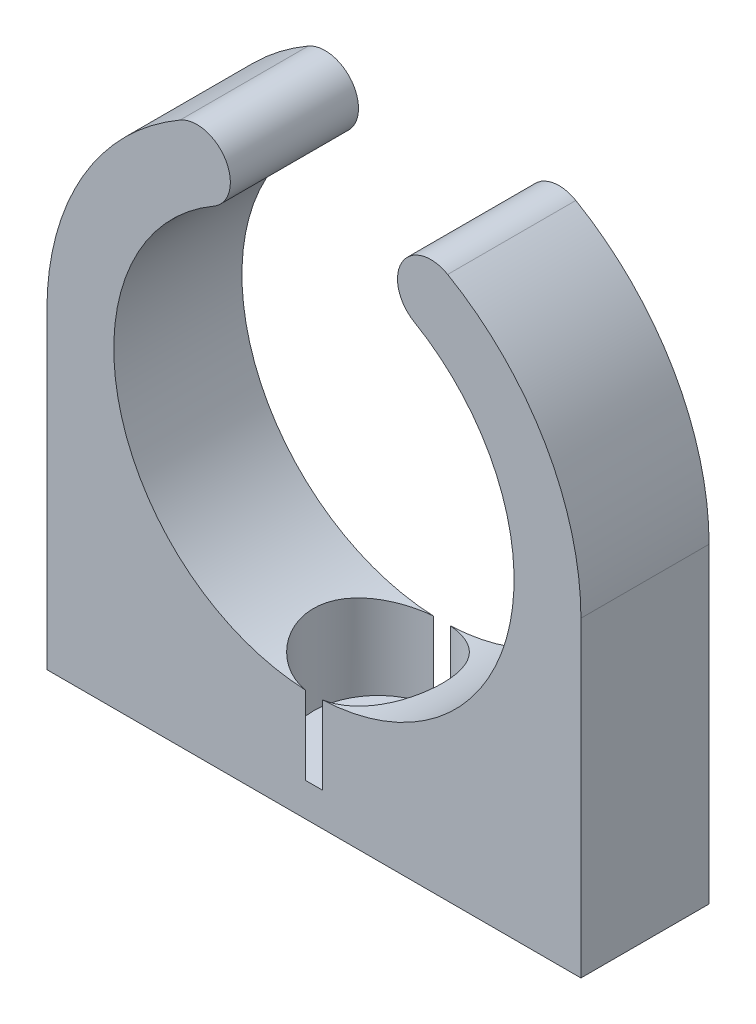
ISO-10303-21;
HEADER;
FILE_DESCRIPTION(('STEP AP214'),'2;1');
FILE_NAME('part.step','',(''),(''),'','','');
FILE_SCHEMA(('AUTOMOTIVE_DESIGN { 1 0 10303 214 1 1 1 1 }'));
ENDSEC;
DATA;
#1=APPLICATION_CONTEXT('core data for automotive mechanical design processes');
#2=APPLICATION_PROTOCOL_DEFINITION('international standard','automotive_design',2000,#1);
#3=PRODUCT_CONTEXT('',#1,'mechanical');
#4=PRODUCT('Part','Part','',(#3));
#5=PRODUCT_RELATED_PRODUCT_CATEGORY('part','',(#4));
#6=PRODUCT_DEFINITION_FORMATION('','',#4);
#7=PRODUCT_DEFINITION_CONTEXT('part definition',#1,'design');
#8=PRODUCT_DEFINITION('design','',#6,#7);
#9=PRODUCT_DEFINITION_SHAPE('','',#8);
#10=(LENGTH_UNIT() NAMED_UNIT(*) SI_UNIT(.MILLI.,.METRE.));
#11=(NAMED_UNIT(*) PLANE_ANGLE_UNIT() SI_UNIT($,.RADIAN.));
#12=(NAMED_UNIT(*) SI_UNIT($,.STERADIAN.) SOLID_ANGLE_UNIT());
#13=UNCERTAINTY_MEASURE_WITH_UNIT(LENGTH_MEASURE(1.E-05),#10,'distance_accuracy_value','');
#14=(GEOMETRIC_REPRESENTATION_CONTEXT(3) GLOBAL_UNCERTAINTY_ASSIGNED_CONTEXT((#13)) GLOBAL_UNIT_ASSIGNED_CONTEXT((#10,
#11,#12)) REPRESENTATION_CONTEXT('',''));
#15=CARTESIAN_POINT('',(0.,0.,0.));
#16=DIRECTION('',(0.,0.,1.));
#17=DIRECTION('',(1.,0.,0.));
#18=AXIS2_PLACEMENT_3D('',#15,#16,#17);
#19=CARTESIAN_POINT('',(0.,0.,2.875));
#20=DIRECTION('',(0.,0.,-1.));
#21=DIRECTION('',(-1.,0.,0.));
#22=AXIS2_PLACEMENT_3D('',#19,#20,#21);
#23=CYLINDRICAL_SURFACE('',#22,8.98);
#24=CARTESIAN_POINT('',(0.,0.,2.875));
#25=DIRECTION('',(0.,0.,1.));
#26=DIRECTION('',(1.,0.,0.));
#27=AXIS2_PLACEMENT_3D('',#24,#25,#26);
#28=CIRCLE('',#27,8.98);
#29=CARTESIAN_POINT('',(-4.49856870229008,7.77195468532699,2.875));
#30=VERTEX_POINT('',#29);
#31=CARTESIAN_POINT('',(-0.379967103839266,-8.97195770163904,2.875));
#32=VERTEX_POINT('',#31);
#33=EDGE_CURVE('E151',#30,#32,#28,.T.);
#34=ORIENTED_EDGE('',*,*,#33,.T.);
#35=CARTESIAN_POINT('',(-0.379967103839266,-8.97195770163904,2.875));
#36=CARTESIAN_POINT('',(-0.459845639301978,-8.96858430212903,2.86445262609925));
#37=CARTESIAN_POINT('',(-0.539227602697056,-8.96414449086685,2.85056493302316));
#38=CARTESIAN_POINT('',(-0.696414384816211,-8.95329921369239,2.81628506390156));
#39=CARTESIAN_POINT('',(-0.774219657978788,-8.94689432300507,2.79589479124516));
#40=CARTESIAN_POINT('',(-0.927526039668131,-8.93230201155118,2.74883798975461));
#41=CARTESIAN_POINT('',(-1.00303238547707,-8.92411905225874,2.7221871563894));
#42=CARTESIAN_POINT('',(-1.15141235372364,-8.90619131708153,2.66282610882623));
#43=CARTESIAN_POINT('',(-1.22428584634609,-8.89644646431465,2.63011559633633));
#44=CARTESIAN_POINT('',(-1.43813397215306,-8.86526003542904,2.52331037534382));
#45=CARTESIAN_POINT('',(-1.57457640168037,-8.84184250944374,2.44046773823353));
#46=CARTESIAN_POINT('',(-1.83172853615455,-8.79217821047951,2.2538998153558));
#47=CARTESIAN_POINT('',(-1.95242967411503,-8.76592991096894,2.150163235833));
#48=CARTESIAN_POINT('',(-2.17873128709903,-8.71248882851368,1.92089703246865));
#49=CARTESIAN_POINT('',(-2.28375241749192,-8.68529184797946,1.79479476769927));
#50=CARTESIAN_POINT('',(-2.47128835165984,-8.63380706883704,1.52628747820874));
#51=CARTESIAN_POINT('',(-2.55380256440728,-8.60951934663483,1.38388202550821));
#52=CARTESIAN_POINT('',(-2.69400698524796,-8.56668789213428,1.08603599691442));
#53=CARTESIAN_POINT('',(-2.75163375085362,-8.54815887306589,0.930563300220168));
#54=CARTESIAN_POINT('',(-2.83964633781408,-8.51933030779636,0.611379302776912));
#55=CARTESIAN_POINT('',(-2.87004384035281,-8.50902723292289,0.447671566672562));
#56=CARTESIAN_POINT('',(-2.90162654072626,-8.49830712832082,0.124937537014367));
#57=CARTESIAN_POINT('',(-2.9041179676022,-8.49744807902226,-0.0339469918902598));
#58=CARTESIAN_POINT('',(-2.88317432511762,-8.50457673918962,-0.349781974285165));
#59=CARTESIAN_POINT('',(-2.85974153305277,-8.51256367158627,-0.506732596433656));
#60=CARTESIAN_POINT('',(-2.7886445559745,-8.5361118348426,-0.810744532742545));
#61=CARTESIAN_POINT('',(-2.74152445131571,-8.5515026758208,-0.95794740600373));
#62=CARTESIAN_POINT('',(-2.62488609784777,-8.58802000834827,-1.24242479486658));
#63=CARTESIAN_POINT('',(-2.55536336620394,-8.6091476477153,-1.37969731663677));
#64=CARTESIAN_POINT('',(-2.39281596524695,-8.65576271046042,-1.64611752922154));
#65=CARTESIAN_POINT('',(-2.298996906675,-8.68138555519419,-1.77475651487513));
#66=CARTESIAN_POINT('',(-2.09171635557703,-8.73364350144492,-2.01491854446436));
#67=CARTESIAN_POINT('',(-1.9782474900497,-8.76027897998399,-2.12643513399513));
#68=CARTESIAN_POINT('',(-1.72954615308363,-8.81282231625393,-2.33364399164502));
#69=CARTESIAN_POINT('',(-1.59363008392166,-8.83865965892488,-2.42853532673288));
#70=CARTESIAN_POINT('',(-1.30706243057084,-8.8855492960951,-2.59401213848305));
#71=CARTESIAN_POINT('',(-1.1564260848736,-8.90660646553637,-2.66462241577347));
#72=CARTESIAN_POINT('',(-0.900601768150329,-8.93529289974995,-2.75867483274021));
#73=CARTESIAN_POINT('',(-0.798463746828074,-8.9450302042773,-2.7899526897001));
#74=CARTESIAN_POINT('',(-0.591181820631186,-8.9611275384779,-2.84111161260719));
#75=CARTESIAN_POINT('',(-0.486039728357152,-8.96748956120239,-2.86099940476281));
#76=CARTESIAN_POINT('',(-0.379967103839266,-8.97195770163903,-2.875));
#77=B_SPLINE_CURVE_WITH_KNOTS('',3,(#35,#36,#37,#38,#39,#40,#41,#42,#43,#44,#45,#46,#47,#48,#49,
#50,#51,#52,#53,#54,#55,#56,#57,#58,#59,#60,#61,#62,#63,#64,#65,#66,#67,#68,#69,#70,#71,#72,#73,
#74,#75,#76),.UNSPECIFIED.,.F.,.F.,(4,2,2,2,2,2,2,2,2,2,2,2,2,2,2,2,2,2,2,2,4),(0.,
0.241834320664802,0.483597918171472,0.724761754484338,0.965937465411887,1.44754078454633,
1.92940512563786,2.42610537759678,2.92281867155903,3.42079080669345,3.91854921243972,
4.39290544089876,4.86722000316064,5.33110624963385,5.79508537887748,6.27673919028338,
6.7585741209926,7.25947826308597,7.75986925227529,8.08100558115314,8.40195207239),.UNSPECIFIED.);
#78=CARTESIAN_POINT('',(-0.379967103839266,-8.97195770163904,-2.875));
#79=VERTEX_POINT('',#78);
#80=EDGE_CURVE('E244',#32,#79,#77,.T.);
#81=ORIENTED_EDGE('',*,*,#80,.T.);
#82=CARTESIAN_POINT('',(0.,0.,-2.875));
#83=DIRECTION('',(0.,0.,1.));
#84=DIRECTION('',(1.,0.,0.));
#85=AXIS2_PLACEMENT_3D('',#82,#83,#84);
#86=CIRCLE('',#85,8.98);
#87=CARTESIAN_POINT('',(-4.49856870229008,7.77195468532699,-2.875));
#88=VERTEX_POINT('',#87);
#89=EDGE_CURVE('E172',#88,#79,#86,.T.);
#90=ORIENTED_EDGE('',*,*,#89,.F.);
#91=DIRECTION('',(0.,0.,-1.));
#92=VECTOR('',#91,1.);
#93=CARTESIAN_POINT('',(-4.49856870229008,7.77195468532699,2.875));
#94=LINE('',#93,#92);
#95=EDGE_CURVE('E64',#30,#88,#94,.T.);
#96=ORIENTED_EDGE('',*,*,#95,.F.);
#97=EDGE_LOOP('',(#34,#81,#90,#96));
#98=FACE_BOUND('',#97,.T.);
#99=ADVANCED_FACE('F40',(#98),#23,.F.);
#100=CARTESIAN_POINT('',(0.379967103839267,-8.97195770163904,-2.875));
#101=VERTEX_POINT('',#100);
#102=CARTESIAN_POINT('',(4.49856870229008,7.77195468532699,-2.875));
#103=VERTEX_POINT('',#102);
#104=EDGE_CURVE('E171',#101,#103,#86,.T.);
#105=ORIENTED_EDGE('',*,*,#104,.F.);
#106=CARTESIAN_POINT('',(0.379967103839267,-8.97195770163904,-2.875));
#107=CARTESIAN_POINT('',(0.459845639301978,-8.96858430212903,-2.86445262609924));
#108=CARTESIAN_POINT('',(0.539227602697056,-8.96414449086685,-2.85056493302316));
#109=CARTESIAN_POINT('',(0.696414384816211,-8.95329921369239,-2.81628506390156));
#110=CARTESIAN_POINT('',(0.774219657978788,-8.94689432300507,-2.79589479124516));
#111=CARTESIAN_POINT('',(0.927526039668131,-8.93230201155118,-2.74883798975461));
#112=CARTESIAN_POINT('',(1.00303238547707,-8.92411905225874,-2.7221871563894));
#113=CARTESIAN_POINT('',(1.15141235372364,-8.90619131708153,-2.66282610882623));
#114=CARTESIAN_POINT('',(1.22428584634609,-8.89644646431465,-2.63011559633633));
#115=CARTESIAN_POINT('',(1.43813397215306,-8.86526003542904,-2.52331037534382));
#116=CARTESIAN_POINT('',(1.57457640168037,-8.84184250944374,-2.44046773823353));
#117=CARTESIAN_POINT('',(1.83172853615455,-8.79217821047951,-2.2538998153558));
#118=CARTESIAN_POINT('',(1.95242967411503,-8.76592991096894,-2.150163235833));
#119=CARTESIAN_POINT('',(2.17873128709903,-8.71248882851368,-1.92089703246865));
#120=CARTESIAN_POINT('',(2.28375241749192,-8.68529184797946,-1.79479476769927));
#121=CARTESIAN_POINT('',(2.47128835165984,-8.63380706883704,-1.52628747820874));
#122=CARTESIAN_POINT('',(2.55380256440728,-8.60951934663483,-1.38388202550821));
#123=CARTESIAN_POINT('',(2.69400698524796,-8.56668789213428,-1.08603599691442));
#124=CARTESIAN_POINT('',(2.75163375085362,-8.54815887306589,-0.930563300220169));
#125=CARTESIAN_POINT('',(2.83964633781408,-8.51933030779636,-0.611379302776912));
#126=CARTESIAN_POINT('',(2.87004384035281,-8.50902723292288,-0.447671566672563));
#127=CARTESIAN_POINT('',(2.90162654072626,-8.49830712832082,-0.124937537014369));
#128=CARTESIAN_POINT('',(2.9041179676022,-8.49744807902225,0.0339469918902585));
#129=CARTESIAN_POINT('',(2.88317432511762,-8.50457673918962,0.349781974285163));
#130=CARTESIAN_POINT('',(2.85974153305277,-8.51256367158627,0.506732596433655));
#131=CARTESIAN_POINT('',(2.7886445559745,-8.5361118348426,0.810744532742544));
#132=CARTESIAN_POINT('',(2.74152445131571,-8.55150267582081,0.957947406003728));
#133=CARTESIAN_POINT('',(2.62488609784778,-8.58802000834827,1.24242479486658));
#134=CARTESIAN_POINT('',(2.55536336620394,-8.60914764771531,1.37969731663677));
#135=CARTESIAN_POINT('',(2.39281596524695,-8.65576271046042,1.64611752922154));
#136=CARTESIAN_POINT('',(2.29899690667501,-8.68138555519419,1.77475651487513));
#137=CARTESIAN_POINT('',(2.09171635557703,-8.73364350144492,2.01491854446436));
#138=CARTESIAN_POINT('',(1.9782474900497,-8.76027897998399,2.12643513399513));
#139=CARTESIAN_POINT('',(1.72954615308363,-8.81282231625393,2.33364399164502));
#140=CARTESIAN_POINT('',(1.59363008392166,-8.83865965892488,2.42853532673288));
#141=CARTESIAN_POINT('',(1.30706243057084,-8.8855492960951,2.59401213848305));
#142=CARTESIAN_POINT('',(1.15642608487361,-8.90660646553637,2.66462241577347));
#143=CARTESIAN_POINT('',(0.900601768150331,-8.93529289974995,2.75867483274021));
#144=CARTESIAN_POINT('',(0.798463746828076,-8.9450302042773,2.7899526897001));
#145=CARTESIAN_POINT('',(0.591181820631187,-8.9611275384779,2.84111161260719));
#146=CARTESIAN_POINT('',(0.486039728357153,-8.96748956120239,2.86099940476281));
#147=CARTESIAN_POINT('',(0.379967103839266,-8.97195770163903,2.875));
#148=B_SPLINE_CURVE_WITH_KNOTS('',3,(#106,#107,#108,#109,#110,#111,#112,#113,#114,#115,#116,
#117,#118,#119,#120,#121,#122,#123,#124,#125,#126,#127,#128,#129,#130,#131,#132,#133,#134,#135,
#136,#137,#138,#139,#140,#141,#142,#143,#144,#145,#146,#147),.UNSPECIFIED.,.F.,.F.,(4,2,2,2,2,2,
2,2,2,2,2,2,2,2,2,2,2,2,2,2,4),(0.,0.241834320664802,0.483597918171471,0.724761754484338,
0.965937465411887,1.44754078454633,1.92940512563786,2.42610537759678,2.92281867155903,
3.42079080669345,3.91854921243972,4.39290544089876,4.86722000316064,5.33110624963385,
5.79508537887749,6.27673919028338,6.7585741209926,7.25947826308597,7.7598692522753,
8.08100558115315,8.40195207239),.UNSPECIFIED.);
#149=CARTESIAN_POINT('',(0.379967103839267,-8.97195770163904,2.875));
#150=VERTEX_POINT('',#149);
#151=EDGE_CURVE('E199',#101,#150,#148,.T.);
#152=ORIENTED_EDGE('',*,*,#151,.T.);
#153=CARTESIAN_POINT('',(4.49856870229008,7.77195468532699,2.875));
#154=VERTEX_POINT('',#153);
#155=EDGE_CURVE('E149',#150,#154,#28,.T.);
#156=ORIENTED_EDGE('',*,*,#155,.T.);
#157=DIRECTION('',(0.,0.,-1.));
#158=VECTOR('',#157,1.);
#159=CARTESIAN_POINT('',(4.49856870229008,7.77195468532699,2.875));
#160=LINE('',#159,#158);
#161=EDGE_CURVE('E145',#154,#103,#160,.T.);
#162=ORIENTED_EDGE('',*,*,#161,.T.);
#163=EDGE_LOOP('',(#105,#152,#156,#162));
#164=FACE_BOUND('',#163,.T.);
#165=ADVANCED_FACE('F267',(#164),#23,.F.);
#166=CARTESIAN_POINT('',(0.,0.,2.875));
#167=DIRECTION('',(0.,0.,1.));
#168=DIRECTION('',(1.,0.,0.));
#169=AXIS2_PLACEMENT_3D('',#166,#167,#168);
#170=PLANE('',#169);
#171=DIRECTION('',(-1.,0.,0.));
#172=VECTOR('',#171,1.);
#173=CARTESIAN_POINT('',(0.,-12.48,2.875));
#174=LINE('',#173,#172);
#175=CARTESIAN_POINT('',(0.379967103839267,-12.48,2.875));
#176=VERTEX_POINT('',#175);
#177=CARTESIAN_POINT('',(-0.379967103839266,-12.48,2.875));
#178=VERTEX_POINT('',#177);
#179=EDGE_CURVE('E218',#176,#178,#174,.T.);
#180=ORIENTED_EDGE('',*,*,#179,.T.);
#181=DIRECTION('',(0.,-1.,0.));
#182=VECTOR('',#181,1.);
#183=CARTESIAN_POINT('',(-0.379967103839266,-13.98,2.875));
#184=LINE('',#183,#182);
#185=EDGE_CURVE('E158',#178,#32,#184,.F.);
#186=ORIENTED_EDGE('',*,*,#185,.T.);
#187=ORIENTED_EDGE('',*,*,#33,.F.);
#188=CARTESIAN_POINT('',(-5.25,9.07016537886713,2.875));
#189=DIRECTION('',(0.,0.,1.));
#190=DIRECTION('',(1.,0.,0.));
#191=AXIS2_PLACEMENT_3D('',#188,#189,#190);
#192=CIRCLE('',#191,1.5);
#193=CARTESIAN_POINT('',(-6.00143129770993,10.3683760724073,2.875));
#194=VERTEX_POINT('',#193);
#195=EDGE_CURVE('E175',#30,#194,#192,.T.);
#196=ORIENTED_EDGE('',*,*,#195,.T.);
#197=CARTESIAN_POINT('',(0.,0.,2.875));
#198=DIRECTION('',(0.,0.,1.));
#199=DIRECTION('',(1.,0.,0.));
#200=AXIS2_PLACEMENT_3D('',#197,#198,#199);
#201=CIRCLE('',#200,11.98);
#202=CARTESIAN_POINT('',(-11.98,0.,2.875));
#203=VERTEX_POINT('',#202);
#204=EDGE_CURVE('E104',#194,#203,#201,.T.);
#205=ORIENTED_EDGE('',*,*,#204,.T.);
#206=DIRECTION('',(0.,1.,0.));
#207=VECTOR('',#206,1.);
#208=CARTESIAN_POINT('',(-11.98,0.,2.875));
#209=LINE('',#208,#207);
#210=CARTESIAN_POINT('',(-11.98,-13.98,2.875));
#211=VERTEX_POINT('',#210);
#212=EDGE_CURVE('E253',#211,#203,#209,.T.);
#213=ORIENTED_EDGE('',*,*,#212,.F.);
#214=DIRECTION('',(1.,0.,0.));
#215=VECTOR('',#214,1.);
#216=CARTESIAN_POINT('',(0.,-13.98,2.875));
#217=LINE('',#216,#215);
#218=CARTESIAN_POINT('',(11.98,-13.98,2.875));
#219=VERTEX_POINT('',#218);
#220=EDGE_CURVE('E256',#211,#219,#217,.T.);
#221=ORIENTED_EDGE('',*,*,#220,.T.);
#222=DIRECTION('',(0.,1.,0.));
#223=VECTOR('',#222,1.);
#224=CARTESIAN_POINT('',(11.98,0.,2.875));
#225=LINE('',#224,#223);
#226=CARTESIAN_POINT('',(11.98,0.,2.875));
#227=VERTEX_POINT('',#226);
#228=EDGE_CURVE('E131',#219,#227,#225,.T.);
#229=ORIENTED_EDGE('',*,*,#228,.T.);
#230=CARTESIAN_POINT('',(0.,0.,2.875));
#231=DIRECTION('',(0.,0.,1.));
#232=DIRECTION('',(1.,0.,0.));
#233=AXIS2_PLACEMENT_3D('',#230,#231,#232);
#234=CIRCLE('',#233,11.98);
#235=CARTESIAN_POINT('',(6.00143129770993,10.3683760724073,2.875));
#236=VERTEX_POINT('',#235);
#237=EDGE_CURVE('E122',#227,#236,#234,.T.);
#238=ORIENTED_EDGE('',*,*,#237,.T.);
#239=CARTESIAN_POINT('',(5.25,9.07016537886714,2.875));
#240=DIRECTION('',(0.,0.,1.));
#241=DIRECTION('',(1.,0.,0.));
#242=AXIS2_PLACEMENT_3D('',#239,#240,#241);
#243=CIRCLE('',#242,1.5);
#244=EDGE_CURVE('E128',#236,#154,#243,.T.);
#245=ORIENTED_EDGE('',*,*,#244,.T.);
#246=ORIENTED_EDGE('',*,*,#155,.F.);
#247=DIRECTION('',(0.,-1.,0.));
#248=VECTOR('',#247,1.);
#249=CARTESIAN_POINT('',(0.379967103839267,-13.98,2.875));
#250=LINE('',#249,#248);
#251=EDGE_CURVE('E232',#150,#176,#250,.T.);
#252=ORIENTED_EDGE('',*,*,#251,.T.);
#253=EDGE_LOOP('',(#180,#186,#187,#196,#205,#213,#221,#229,#238,#245,#246,#252));
#254=FACE_BOUND('',#253,.T.);
#255=ADVANCED_FACE('F125',(#254),#170,.T.);
#256=CARTESIAN_POINT('',(0.,0.,-2.875));
#257=DIRECTION('',(0.,0.,1.));
#258=DIRECTION('',(1.,0.,0.));
#259=AXIS2_PLACEMENT_3D('',#256,#257,#258);
#260=PLANE('',#259);
#261=DIRECTION('',(0.,-1.,0.));
#262=VECTOR('',#261,1.);
#263=CARTESIAN_POINT('',(-0.379967103839266,-13.98,-2.875));
#264=LINE('',#263,#262);
#265=CARTESIAN_POINT('',(-0.379967103839266,-12.48,-2.875));
#266=VERTEX_POINT('',#265);
#267=EDGE_CURVE('E11',#266,#79,#264,.F.);
#268=ORIENTED_EDGE('',*,*,#267,.F.);
#269=DIRECTION('',(-1.,0.,0.));
#270=VECTOR('',#269,1.);
#271=CARTESIAN_POINT('',(0.,-12.48,-2.875));
#272=LINE('',#271,#270);
#273=CARTESIAN_POINT('',(0.379967103839267,-12.48,-2.875));
#274=VERTEX_POINT('',#273);
#275=EDGE_CURVE('E188',#274,#266,#272,.T.);
#276=ORIENTED_EDGE('',*,*,#275,.F.);
#277=DIRECTION('',(0.,-1.,0.));
#278=VECTOR('',#277,1.);
#279=CARTESIAN_POINT('',(0.379967103839267,-13.98,-2.875));
#280=LINE('',#279,#278);
#281=EDGE_CURVE('E48',#101,#274,#280,.T.);
#282=ORIENTED_EDGE('',*,*,#281,.F.);
#283=ORIENTED_EDGE('',*,*,#104,.T.);
#284=CARTESIAN_POINT('',(5.25,9.07016537886714,-2.875));
#285=DIRECTION('',(0.,0.,1.));
#286=DIRECTION('',(1.,0.,0.));
#287=AXIS2_PLACEMENT_3D('',#284,#285,#286);
#288=CIRCLE('',#287,1.5);
#289=CARTESIAN_POINT('',(6.00143129770993,10.3683760724073,-2.875));
#290=VERTEX_POINT('',#289);
#291=EDGE_CURVE('E169',#290,#103,#288,.T.);
#292=ORIENTED_EDGE('',*,*,#291,.F.);
#293=CARTESIAN_POINT('',(0.,0.,-2.875));
#294=DIRECTION('',(0.,0.,1.));
#295=DIRECTION('',(1.,0.,0.));
#296=AXIS2_PLACEMENT_3D('',#293,#294,#295);
#297=CIRCLE('',#296,11.98);
#298=CARTESIAN_POINT('',(11.98,0.,-2.875));
#299=VERTEX_POINT('',#298);
#300=EDGE_CURVE('E140',#299,#290,#297,.T.);
#301=ORIENTED_EDGE('',*,*,#300,.F.);
#302=DIRECTION('',(0.,1.,0.));
#303=VECTOR('',#302,1.);
#304=CARTESIAN_POINT('',(11.98,0.,-2.875));
#305=LINE('',#304,#303);
#306=CARTESIAN_POINT('',(11.98,-13.98,-2.875));
#307=VERTEX_POINT('',#306);
#308=EDGE_CURVE('E166',#307,#299,#305,.T.);
#309=ORIENTED_EDGE('',*,*,#308,.F.);
#310=DIRECTION('',(1.,0.,0.));
#311=VECTOR('',#310,1.);
#312=CARTESIAN_POINT('',(0.,-13.98,-2.875));
#313=LINE('',#312,#311);
#314=CARTESIAN_POINT('',(-11.98,-13.98,-2.875));
#315=VERTEX_POINT('',#314);
#316=EDGE_CURVE('E164',#315,#307,#313,.T.);
#317=ORIENTED_EDGE('',*,*,#316,.F.);
#318=DIRECTION('',(0.,1.,0.));
#319=VECTOR('',#318,1.);
#320=CARTESIAN_POINT('',(-11.98,0.,-2.875));
#321=LINE('',#320,#319);
#322=CARTESIAN_POINT('',(-11.98,0.,-2.875));
#323=VERTEX_POINT('',#322);
#324=EDGE_CURVE('E161',#315,#323,#321,.T.);
#325=ORIENTED_EDGE('',*,*,#324,.T.);
#326=CARTESIAN_POINT('',(0.,0.,-2.875));
#327=DIRECTION('',(0.,0.,1.));
#328=DIRECTION('',(1.,0.,0.));
#329=AXIS2_PLACEMENT_3D('',#326,#327,#328);
#330=CIRCLE('',#329,11.98);
#331=CARTESIAN_POINT('',(-6.00143129770993,10.3683760724073,-2.875));
#332=VERTEX_POINT('',#331);
#333=EDGE_CURVE('E157',#332,#323,#330,.T.);
#334=ORIENTED_EDGE('',*,*,#333,.F.);
#335=CARTESIAN_POINT('',(-5.25,9.07016537886713,-2.875));
#336=DIRECTION('',(0.,0.,1.));
#337=DIRECTION('',(1.,0.,0.));
#338=AXIS2_PLACEMENT_3D('',#335,#336,#337);
#339=CIRCLE('',#338,1.5);
#340=EDGE_CURVE('E155',#88,#332,#339,.T.);
#341=ORIENTED_EDGE('',*,*,#340,.F.);
#342=ORIENTED_EDGE('',*,*,#89,.T.);
#343=EDGE_LOOP('',(#268,#276,#282,#283,#292,#301,#309,#317,#325,#334,#341,#342));
#344=FACE_BOUND('',#343,.T.);
#345=ADVANCED_FACE('F203',(#344),#260,.F.);
#346=CARTESIAN_POINT('',(-5.25,9.07016537886713,2.875));
#347=DIRECTION('',(0.,0.,-1.));
#348=DIRECTION('',(-1.,0.,0.));
#349=AXIS2_PLACEMENT_3D('',#346,#347,#348);
#350=CYLINDRICAL_SURFACE('',#349,1.5);
#351=ORIENTED_EDGE('',*,*,#340,.T.);
#352=DIRECTION('',(0.,0.,-1.));
#353=VECTOR('',#352,1.);
#354=CARTESIAN_POINT('',(-6.00143129770993,10.3683760724073,2.875));
#355=LINE('',#354,#353);
#356=EDGE_CURVE('E186',#194,#332,#355,.T.);
#357=ORIENTED_EDGE('',*,*,#356,.F.);
#358=ORIENTED_EDGE('',*,*,#195,.F.);
#359=ORIENTED_EDGE('',*,*,#95,.T.);
#360=EDGE_LOOP('',(#351,#357,#358,#359));
#361=FACE_BOUND('',#360,.T.);
#362=ADVANCED_FACE('F42',(#361),#350,.T.);
#363=CARTESIAN_POINT('',(0.,0.,2.875));
#364=DIRECTION('',(0.,0.,-1.));
#365=DIRECTION('',(-1.,0.,0.));
#366=AXIS2_PLACEMENT_3D('',#363,#364,#365);
#367=CYLINDRICAL_SURFACE('',#366,11.98);
#368=ORIENTED_EDGE('',*,*,#333,.T.);
#369=DIRECTION('',(0.,0.,-1.));
#370=VECTOR('',#369,1.);
#371=CARTESIAN_POINT('',(-11.98,0.,2.875));
#372=LINE('',#371,#370);
#373=EDGE_CURVE('E184',#203,#323,#372,.T.);
#374=ORIENTED_EDGE('',*,*,#373,.F.);
#375=ORIENTED_EDGE('',*,*,#204,.F.);
#376=ORIENTED_EDGE('',*,*,#356,.T.);
#377=EDGE_LOOP('',(#368,#374,#375,#376));
#378=FACE_BOUND('',#377,.T.);
#379=ADVANCED_FACE('F275',(#378),#367,.T.);
#380=CARTESIAN_POINT('',(-11.98,0.,2.875));
#381=DIRECTION('',(-1.,0.,0.));
#382=DIRECTION('',(0.,0.,1.));
#383=AXIS2_PLACEMENT_3D('',#380,#381,#382);
#384=PLANE('',#383);
#385=ORIENTED_EDGE('',*,*,#324,.F.);
#386=DIRECTION('',(0.,0.,-1.));
#387=VECTOR('',#386,1.);
#388=CARTESIAN_POINT('',(-11.98,-13.98,2.875));
#389=LINE('',#388,#387);
#390=EDGE_CURVE('E182',#211,#315,#389,.T.);
#391=ORIENTED_EDGE('',*,*,#390,.F.);
#392=ORIENTED_EDGE('',*,*,#212,.T.);
#393=ORIENTED_EDGE('',*,*,#373,.T.);
#394=EDGE_LOOP('',(#385,#391,#392,#393));
#395=FACE_BOUND('',#394,.T.);
#396=ADVANCED_FACE('F278',(#395),#384,.T.);
#397=CARTESIAN_POINT('',(0.,-13.98,2.875));
#398=DIRECTION('',(0.,1.,0.));
#399=DIRECTION('',(0.,0.,1.));
#400=AXIS2_PLACEMENT_3D('',#397,#398,#399);
#401=PLANE('',#400);
#402=CARTESIAN_POINT('',(0.,-13.98,0.));
#403=DIRECTION('',(0.,-1.,0.));
#404=DIRECTION('',(1.,0.,0.));
#405=AXIS2_PLACEMENT_3D('',#402,#403,#404);
#406=CIRCLE('',#405,1.5);
#407=CARTESIAN_POINT('',(1.5,-13.98,0.));
#408=VERTEX_POINT('',#407);
#409=EDGE_CURVE('E405',#408,#408,#406,.T.);
#410=ORIENTED_EDGE('',*,*,#409,.F.);
#411=EDGE_LOOP('',(#410));
#412=FACE_BOUND('',#411,.T.);
#413=ORIENTED_EDGE('',*,*,#316,.T.);
#414=DIRECTION('',(0.,0.,-1.));
#415=VECTOR('',#414,1.);
#416=CARTESIAN_POINT('',(11.98,-13.98,2.875));
#417=LINE('',#416,#415);
#418=EDGE_CURVE('E179',#219,#307,#417,.T.);
#419=ORIENTED_EDGE('',*,*,#418,.F.);
#420=ORIENTED_EDGE('',*,*,#220,.F.);
#421=ORIENTED_EDGE('',*,*,#390,.T.);
#422=EDGE_LOOP('',(#413,#419,#420,#421));
#423=FACE_BOUND('',#422,.T.);
#424=ADVANCED_FACE('F261',(#412,#423),#401,.F.);
#425=CARTESIAN_POINT('',(11.98,0.,2.875));
#426=DIRECTION('',(-1.,0.,0.));
#427=DIRECTION('',(0.,0.,1.));
#428=AXIS2_PLACEMENT_3D('',#425,#426,#427);
#429=PLANE('',#428);
#430=ORIENTED_EDGE('',*,*,#308,.T.);
#431=DIRECTION('',(0.,0.,-1.));
#432=VECTOR('',#431,1.);
#433=CARTESIAN_POINT('',(11.98,0.,2.875));
#434=LINE('',#433,#432);
#435=EDGE_CURVE('E144',#227,#299,#434,.T.);
#436=ORIENTED_EDGE('',*,*,#435,.F.);
#437=ORIENTED_EDGE('',*,*,#228,.F.);
#438=ORIENTED_EDGE('',*,*,#418,.T.);
#439=EDGE_LOOP('',(#430,#436,#437,#438));
#440=FACE_BOUND('',#439,.T.);
#441=ADVANCED_FACE('F265',(#440),#429,.F.);
#442=CARTESIAN_POINT('',(0.,0.,2.875));
#443=DIRECTION('',(0.,0.,-1.));
#444=DIRECTION('',(-1.,0.,0.));
#445=AXIS2_PLACEMENT_3D('',#442,#443,#444);
#446=CYLINDRICAL_SURFACE('',#445,11.98);
#447=ORIENTED_EDGE('',*,*,#300,.T.);
#448=DIRECTION('',(0.,0.,-1.));
#449=VECTOR('',#448,1.);
#450=CARTESIAN_POINT('',(6.00143129770993,10.3683760724073,2.875));
#451=LINE('',#450,#449);
#452=EDGE_CURVE('E137',#236,#290,#451,.T.);
#453=ORIENTED_EDGE('',*,*,#452,.F.);
#454=ORIENTED_EDGE('',*,*,#237,.F.);
#455=ORIENTED_EDGE('',*,*,#435,.T.);
#456=EDGE_LOOP('',(#447,#453,#454,#455));
#457=FACE_BOUND('',#456,.T.);
#458=ADVANCED_FACE('F138',(#457),#446,.T.);
#459=CARTESIAN_POINT('',(5.25,9.07016537886714,2.875));
#460=DIRECTION('',(0.,0.,-1.));
#461=DIRECTION('',(-1.,0.,0.));
#462=AXIS2_PLACEMENT_3D('',#459,#460,#461);
#463=CYLINDRICAL_SURFACE('',#462,1.5);
#464=ORIENTED_EDGE('',*,*,#291,.T.);
#465=ORIENTED_EDGE('',*,*,#161,.F.);
#466=ORIENTED_EDGE('',*,*,#244,.F.);
#467=ORIENTED_EDGE('',*,*,#452,.T.);
#468=EDGE_LOOP('',(#464,#465,#466,#467));
#469=FACE_BOUND('',#468,.T.);
#470=ADVANCED_FACE('F147',(#469),#463,.T.);
#471=CARTESIAN_POINT('',(0.,-13.98,0.));
#472=DIRECTION('',(0.,-1.,0.));
#473=DIRECTION('',(1.,0.,0.));
#474=AXIS2_PLACEMENT_3D('',#471,#472,#473);
#475=CYLINDRICAL_SURFACE('',#474,2.9);
#476=CARTESIAN_POINT('',(0.,-12.48,0.));
#477=DIRECTION('',(0.,-1.,0.));
#478=DIRECTION('',(1.,0.,0.));
#479=AXIS2_PLACEMENT_3D('',#476,#477,#478);
#480=CIRCLE('',#479,2.9);
#481=EDGE_CURVE('E209',#178,#266,#480,.T.);
#482=ORIENTED_EDGE('',*,*,#481,.T.);
#483=ORIENTED_EDGE('',*,*,#267,.T.);
#484=ORIENTED_EDGE('',*,*,#80,.F.);
#485=ORIENTED_EDGE('',*,*,#185,.F.);
#486=EDGE_LOOP('',(#482,#483,#484,#485));
#487=FACE_BOUND('',#486,.T.);
#488=ADVANCED_FACE('F213',(#487),#475,.F.);
#489=CARTESIAN_POINT('',(0.,-12.48,0.));
#490=DIRECTION('',(0.,1.,0.));
#491=DIRECTION('',(-1.,0.,0.));
#492=AXIS2_PLACEMENT_3D('',#489,#490,#491);
#493=PLANE('',#492);
#494=CARTESIAN_POINT('',(0.,-12.48,0.));
#495=DIRECTION('',(0.,-1.,0.));
#496=DIRECTION('',(1.,0.,0.));
#497=AXIS2_PLACEMENT_3D('',#494,#495,#496);
#498=CIRCLE('',#497,1.5);
#499=CARTESIAN_POINT('',(1.5,-12.48,0.));
#500=VERTEX_POINT('',#499);
#501=EDGE_CURVE('E221',#500,#500,#498,.T.);
#502=ORIENTED_EDGE('',*,*,#501,.T.);
#503=EDGE_LOOP('',(#502));
#504=FACE_BOUND('',#503,.T.);
#505=EDGE_CURVE('E55',#274,#176,#480,.T.);
#506=ORIENTED_EDGE('',*,*,#505,.F.);
#507=ORIENTED_EDGE('',*,*,#275,.T.);
#508=ORIENTED_EDGE('',*,*,#481,.F.);
#509=ORIENTED_EDGE('',*,*,#179,.F.);
#510=EDGE_LOOP('',(#506,#507,#508,#509));
#511=FACE_BOUND('',#510,.T.);
#512=ADVANCED_FACE('F207',(#504,#511),#493,.T.);
#513=ORIENTED_EDGE('',*,*,#151,.F.);
#514=ORIENTED_EDGE('',*,*,#281,.T.);
#515=ORIENTED_EDGE('',*,*,#505,.T.);
#516=ORIENTED_EDGE('',*,*,#251,.F.);
#517=EDGE_LOOP('',(#513,#514,#515,#516));
#518=FACE_BOUND('',#517,.T.);
#519=ADVANCED_FACE('F193',(#518),#475,.F.);
#520=CARTESIAN_POINT('',(0.,-13.98,0.));
#521=DIRECTION('',(0.,-1.,0.));
#522=DIRECTION('',(1.,0.,0.));
#523=AXIS2_PLACEMENT_3D('',#520,#521,#522);
#524=CYLINDRICAL_SURFACE('',#523,1.5);
#525=ORIENTED_EDGE('',*,*,#409,.T.);
#526=EDGE_LOOP('',(#525));
#527=FACE_BOUND('',#526,.T.);
#528=ORIENTED_EDGE('',*,*,#501,.F.);
#529=EDGE_LOOP('',(#528));
#530=FACE_BOUND('',#529,.T.);
#531=ADVANCED_FACE('F241',(#527,#530),#524,.F.);
#532=CLOSED_SHELL('',(#99,#165,#255,#345,#362,#379,#396,#424,#441,#458,#470,#488,#512,#519,#531));
#533=MANIFOLD_SOLID_BREP('B2',#532);
#534=ADVANCED_BREP_SHAPE_REPRESENTATION('',(#18,#533),#14);
#535=SHAPE_DEFINITION_REPRESENTATION(#9,#534);
ENDSEC;
END-ISO-10303-21;
